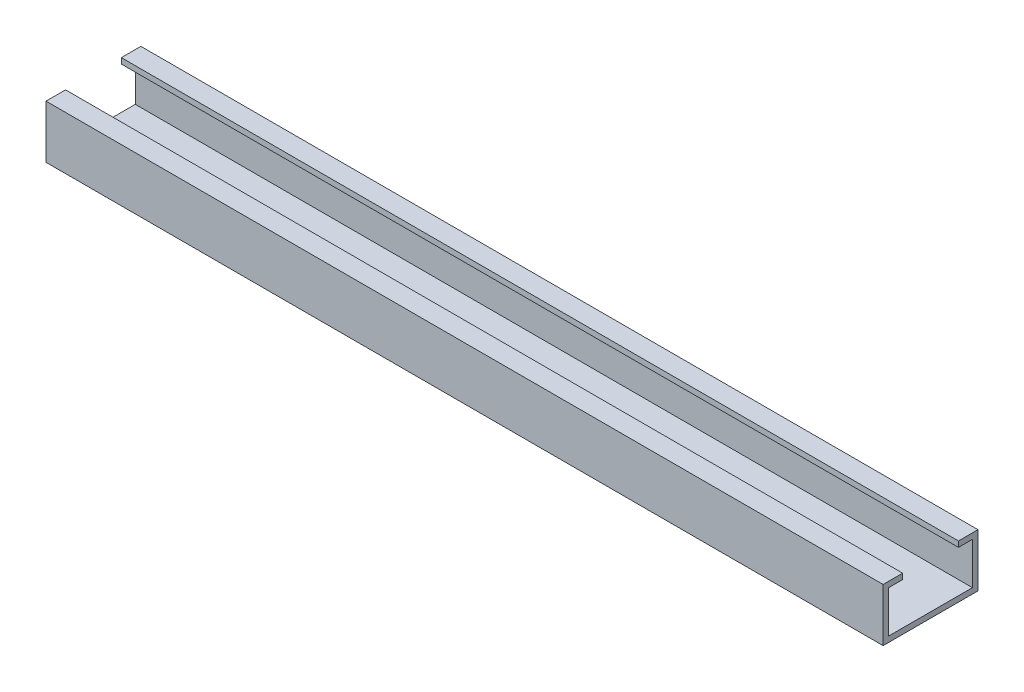
ISO-10303-21;
HEADER;
FILE_DESCRIPTION(('STEP AP214'),'2;1');
FILE_NAME('part.step','',(''),(''),'','','');
FILE_SCHEMA(('AUTOMOTIVE_DESIGN { 1 0 10303 214 1 1 1 1 }'));
ENDSEC;
DATA;
#1=APPLICATION_CONTEXT('core data for automotive mechanical design processes');
#2=APPLICATION_PROTOCOL_DEFINITION('international standard','automotive_design',2000,#1);
#3=PRODUCT_CONTEXT('',#1,'mechanical');
#4=PRODUCT('Part','Part','',(#3));
#5=PRODUCT_RELATED_PRODUCT_CATEGORY('part','',(#4));
#6=PRODUCT_DEFINITION_FORMATION('','',#4);
#7=PRODUCT_DEFINITION_CONTEXT('part definition',#1,'design');
#8=PRODUCT_DEFINITION('design','',#6,#7);
#9=PRODUCT_DEFINITION_SHAPE('','',#8);
#10=(LENGTH_UNIT() NAMED_UNIT(*) SI_UNIT(.MILLI.,.METRE.));
#11=(NAMED_UNIT(*) PLANE_ANGLE_UNIT() SI_UNIT($,.RADIAN.));
#12=(NAMED_UNIT(*) SI_UNIT($,.STERADIAN.) SOLID_ANGLE_UNIT());
#13=UNCERTAINTY_MEASURE_WITH_UNIT(LENGTH_MEASURE(1.E-05),#10,'distance_accuracy_value','');
#14=(GEOMETRIC_REPRESENTATION_CONTEXT(3) GLOBAL_UNCERTAINTY_ASSIGNED_CONTEXT((#13)) GLOBAL_UNIT_ASSIGNED_CONTEXT((#10,
#11,#12)) REPRESENTATION_CONTEXT('',''));
#15=CARTESIAN_POINT('',(0.,0.,0.));
#16=DIRECTION('',(0.,0.,1.));
#17=DIRECTION('',(1.,0.,0.));
#18=AXIS2_PLACEMENT_3D('',#15,#16,#17);
#19=CARTESIAN_POINT('',(300.,17.,-15.));
#20=DIRECTION('',(0.,-1.,0.));
#21=DIRECTION('',(0.,0.,-1.));
#22=AXIS2_PLACEMENT_3D('',#19,#20,#21);
#23=PLANE('',#22);
#24=DIRECTION('',(0.,0.,1.));
#25=VECTOR('',#24,1.);
#26=CARTESIAN_POINT('',(0.,17.,-15.));
#27=LINE('',#26,#25);
#28=CARTESIAN_POINT('',(0.,17.,-17.));
#29=VERTEX_POINT('',#28);
#30=CARTESIAN_POINT('',(0.,17.,-10.));
#31=VERTEX_POINT('',#30);
#32=EDGE_CURVE('E164',#29,#31,#27,.T.);
#33=ORIENTED_EDGE('',*,*,#32,.T.);
#34=DIRECTION('',(-1.,0.,0.));
#35=VECTOR('',#34,1.);
#36=CARTESIAN_POINT('',(300.,17.,-10.));
#37=LINE('',#36,#35);
#38=CARTESIAN_POINT('',(300.,17.,-10.));
#39=VERTEX_POINT('',#38);
#40=EDGE_CURVE('E11',#39,#31,#37,.T.);
#41=ORIENTED_EDGE('',*,*,#40,.F.);
#42=DIRECTION('',(0.,0.,1.));
#43=VECTOR('',#42,1.);
#44=CARTESIAN_POINT('',(300.,17.,-15.));
#45=LINE('',#44,#43);
#46=CARTESIAN_POINT('',(300.,17.,-17.));
#47=VERTEX_POINT('',#46);
#48=EDGE_CURVE('E108',#47,#39,#45,.T.);
#49=ORIENTED_EDGE('',*,*,#48,.F.);
#50=DIRECTION('',(-1.,0.,0.));
#51=VECTOR('',#50,1.);
#52=CARTESIAN_POINT('',(300.,17.,-17.));
#53=LINE('',#52,#51);
#54=EDGE_CURVE('E160',#47,#29,#53,.T.);
#55=ORIENTED_EDGE('',*,*,#54,.T.);
#56=EDGE_LOOP('',(#33,#41,#49,#55));
#57=FACE_BOUND('',#56,.T.);
#58=ADVANCED_FACE('F39',(#57),#23,.F.);
#59=CARTESIAN_POINT('',(300.,15.,-10.));
#60=DIRECTION('',(0.,0.,1.));
#61=DIRECTION('',(1.,0.,0.));
#62=AXIS2_PLACEMENT_3D('',#59,#60,#61);
#63=PLANE('',#62);
#64=DIRECTION('',(0.,1.,0.));
#65=VECTOR('',#64,1.);
#66=CARTESIAN_POINT('',(0.,15.,-10.));
#67=LINE('',#66,#65);
#68=CARTESIAN_POINT('',(0.,15.,-10.));
#69=VERTEX_POINT('',#68);
#70=EDGE_CURVE('E168',#69,#31,#67,.T.);
#71=ORIENTED_EDGE('',*,*,#70,.F.);
#72=DIRECTION('',(-1.,0.,0.));
#73=VECTOR('',#72,1.);
#74=CARTESIAN_POINT('',(300.,15.,-10.));
#75=LINE('',#74,#73);
#76=CARTESIAN_POINT('',(300.,15.,-10.));
#77=VERTEX_POINT('',#76);
#78=EDGE_CURVE('E48',#77,#69,#75,.T.);
#79=ORIENTED_EDGE('',*,*,#78,.F.);
#80=DIRECTION('',(0.,1.,0.));
#81=VECTOR('',#80,1.);
#82=CARTESIAN_POINT('',(300.,15.,-10.));
#83=LINE('',#82,#81);
#84=EDGE_CURVE('E251',#77,#39,#83,.T.);
#85=ORIENTED_EDGE('',*,*,#84,.T.);
#86=ORIENTED_EDGE('',*,*,#40,.T.);
#87=EDGE_LOOP('',(#71,#79,#85,#86));
#88=FACE_BOUND('',#87,.T.);
#89=ADVANCED_FACE('F238',(#88),#63,.T.);
#90=CARTESIAN_POINT('',(300.,15.,-15.));
#91=DIRECTION('',(0.,-1.,0.));
#92=DIRECTION('',(0.,0.,-1.));
#93=AXIS2_PLACEMENT_3D('',#90,#91,#92);
#94=PLANE('',#93);
#95=DIRECTION('',(0.,0.,1.));
#96=VECTOR('',#95,1.);
#97=CARTESIAN_POINT('',(0.,15.,-15.));
#98=LINE('',#97,#96);
#99=CARTESIAN_POINT('',(0.,15.,-15.));
#100=VERTEX_POINT('',#99);
#101=EDGE_CURVE('E172',#100,#69,#98,.T.);
#102=ORIENTED_EDGE('',*,*,#101,.F.);
#103=DIRECTION('',(-1.,0.,0.));
#104=VECTOR('',#103,1.);
#105=CARTESIAN_POINT('',(300.,15.,-15.));
#106=LINE('',#105,#104);
#107=CARTESIAN_POINT('',(300.,15.,-15.));
#108=VERTEX_POINT('',#107);
#109=EDGE_CURVE('E226',#108,#100,#106,.T.);
#110=ORIENTED_EDGE('',*,*,#109,.F.);
#111=DIRECTION('',(0.,0.,1.));
#112=VECTOR('',#111,1.);
#113=CARTESIAN_POINT('',(300.,15.,-15.));
#114=LINE('',#113,#112);
#115=EDGE_CURVE('E235',#108,#77,#114,.T.);
#116=ORIENTED_EDGE('',*,*,#115,.T.);
#117=ORIENTED_EDGE('',*,*,#78,.T.);
#118=EDGE_LOOP('',(#102,#110,#116,#117));
#119=FACE_BOUND('',#118,.T.);
#120=ADVANCED_FACE('F233',(#119),#94,.T.);
#121=CARTESIAN_POINT('',(300.,0.,-15.));
#122=DIRECTION('',(0.,0.,1.));
#123=DIRECTION('',(1.,0.,0.));
#124=AXIS2_PLACEMENT_3D('',#121,#122,#123);
#125=PLANE('',#124);
#126=DIRECTION('',(0.,1.,0.));
#127=VECTOR('',#126,1.);
#128=CARTESIAN_POINT('',(0.,0.,-15.));
#129=LINE('',#128,#127);
#130=CARTESIAN_POINT('',(0.,0.,-15.));
#131=VERTEX_POINT('',#130);
#132=EDGE_CURVE('E176',#131,#100,#129,.T.);
#133=ORIENTED_EDGE('',*,*,#132,.F.);
#134=DIRECTION('',(-1.,0.,0.));
#135=VECTOR('',#134,1.);
#136=CARTESIAN_POINT('',(300.,0.,-15.));
#137=LINE('',#136,#135);
#138=CARTESIAN_POINT('',(300.,0.,-15.));
#139=VERTEX_POINT('',#138);
#140=EDGE_CURVE('E223',#139,#131,#137,.T.);
#141=ORIENTED_EDGE('',*,*,#140,.F.);
#142=DIRECTION('',(0.,1.,0.));
#143=VECTOR('',#142,1.);
#144=CARTESIAN_POINT('',(300.,0.,-15.));
#145=LINE('',#144,#143);
#146=EDGE_CURVE('E248',#139,#108,#145,.T.);
#147=ORIENTED_EDGE('',*,*,#146,.T.);
#148=ORIENTED_EDGE('',*,*,#109,.T.);
#149=EDGE_LOOP('',(#133,#141,#147,#148));
#150=FACE_BOUND('',#149,.T.);
#151=ADVANCED_FACE('F245',(#150),#125,.T.);
#152=CARTESIAN_POINT('',(300.,0.,15.));
#153=DIRECTION('',(0.,1.,0.));
#154=DIRECTION('',(0.,0.,1.));
#155=AXIS2_PLACEMENT_3D('',#152,#153,#154);
#156=PLANE('',#155);
#157=DIRECTION('',(0.,0.,-1.));
#158=VECTOR('',#157,1.);
#159=CARTESIAN_POINT('',(0.,0.,15.));
#160=LINE('',#159,#158);
#161=CARTESIAN_POINT('',(0.,0.,15.));
#162=VERTEX_POINT('',#161);
#163=EDGE_CURVE('E180',#162,#131,#160,.T.);
#164=ORIENTED_EDGE('',*,*,#163,.F.);
#165=DIRECTION('',(-1.,0.,0.));
#166=VECTOR('',#165,1.);
#167=CARTESIAN_POINT('',(300.,0.,15.));
#168=LINE('',#167,#166);
#169=CARTESIAN_POINT('',(300.,0.,15.));
#170=VERTEX_POINT('',#169);
#171=EDGE_CURVE('E220',#170,#162,#168,.T.);
#172=ORIENTED_EDGE('',*,*,#171,.F.);
#173=DIRECTION('',(0.,0.,-1.));
#174=VECTOR('',#173,1.);
#175=CARTESIAN_POINT('',(300.,0.,15.));
#176=LINE('',#175,#174);
#177=EDGE_CURVE('E256',#170,#139,#176,.T.);
#178=ORIENTED_EDGE('',*,*,#177,.T.);
#179=ORIENTED_EDGE('',*,*,#140,.T.);
#180=EDGE_LOOP('',(#164,#172,#178,#179));
#181=FACE_BOUND('',#180,.T.);
#182=ADVANCED_FACE('F361',(#181),#156,.T.);
#183=CARTESIAN_POINT('',(300.,0.,15.));
#184=DIRECTION('',(0.,0.,-1.));
#185=DIRECTION('',(-1.,0.,0.));
#186=AXIS2_PLACEMENT_3D('',#183,#184,#185);
#187=PLANE('',#186);
#188=DIRECTION('',(0.,-1.,0.));
#189=VECTOR('',#188,1.);
#190=CARTESIAN_POINT('',(0.,0.,15.));
#191=LINE('',#190,#189);
#192=CARTESIAN_POINT('',(0.,15.,15.));
#193=VERTEX_POINT('',#192);
#194=EDGE_CURVE('E184',#193,#162,#191,.T.);
#195=ORIENTED_EDGE('',*,*,#194,.F.);
#196=DIRECTION('',(-1.,0.,0.));
#197=VECTOR('',#196,1.);
#198=CARTESIAN_POINT('',(300.,15.,15.));
#199=LINE('',#198,#197);
#200=CARTESIAN_POINT('',(300.,15.,15.));
#201=VERTEX_POINT('',#200);
#202=EDGE_CURVE('E217',#201,#193,#199,.T.);
#203=ORIENTED_EDGE('',*,*,#202,.F.);
#204=DIRECTION('',(0.,-1.,0.));
#205=VECTOR('',#204,1.);
#206=CARTESIAN_POINT('',(300.,0.,15.));
#207=LINE('',#206,#205);
#208=EDGE_CURVE('E263',#201,#170,#207,.T.);
#209=ORIENTED_EDGE('',*,*,#208,.T.);
#210=ORIENTED_EDGE('',*,*,#171,.T.);
#211=EDGE_LOOP('',(#195,#203,#209,#210));
#212=FACE_BOUND('',#211,.T.);
#213=ADVANCED_FACE('F352',(#212),#187,.T.);
#214=CARTESIAN_POINT('',(300.,15.,15.));
#215=DIRECTION('',(0.,-1.,0.));
#216=DIRECTION('',(0.,0.,-1.));
#217=AXIS2_PLACEMENT_3D('',#214,#215,#216);
#218=PLANE('',#217);
#219=DIRECTION('',(0.,0.,1.));
#220=VECTOR('',#219,1.);
#221=CARTESIAN_POINT('',(0.,15.,15.));
#222=LINE('',#221,#220);
#223=CARTESIAN_POINT('',(0.,15.,10.));
#224=VERTEX_POINT('',#223);
#225=EDGE_CURVE('E188',#224,#193,#222,.T.);
#226=ORIENTED_EDGE('',*,*,#225,.F.);
#227=DIRECTION('',(-1.,0.,0.));
#228=VECTOR('',#227,1.);
#229=CARTESIAN_POINT('',(300.,15.,10.));
#230=LINE('',#229,#228);
#231=CARTESIAN_POINT('',(300.,15.,10.));
#232=VERTEX_POINT('',#231);
#233=EDGE_CURVE('E214',#232,#224,#230,.T.);
#234=ORIENTED_EDGE('',*,*,#233,.F.);
#235=DIRECTION('',(0.,0.,1.));
#236=VECTOR('',#235,1.);
#237=CARTESIAN_POINT('',(300.,15.,15.));
#238=LINE('',#237,#236);
#239=EDGE_CURVE('E267',#232,#201,#238,.T.);
#240=ORIENTED_EDGE('',*,*,#239,.T.);
#241=ORIENTED_EDGE('',*,*,#202,.T.);
#242=EDGE_LOOP('',(#226,#234,#240,#241));
#243=FACE_BOUND('',#242,.T.);
#244=ADVANCED_FACE('F282',(#243),#218,.T.);
#245=CARTESIAN_POINT('',(300.,17.,10.));
#246=DIRECTION('',(0.,0.,-1.));
#247=DIRECTION('',(-1.,0.,0.));
#248=AXIS2_PLACEMENT_3D('',#245,#246,#247);
#249=PLANE('',#248);
#250=DIRECTION('',(0.,-1.,0.));
#251=VECTOR('',#250,1.);
#252=CARTESIAN_POINT('',(0.,17.,10.));
#253=LINE('',#252,#251);
#254=CARTESIAN_POINT('',(0.,17.,10.));
#255=VERTEX_POINT('',#254);
#256=EDGE_CURVE('E192',#255,#224,#253,.T.);
#257=ORIENTED_EDGE('',*,*,#256,.F.);
#258=DIRECTION('',(-1.,0.,0.));
#259=VECTOR('',#258,1.);
#260=CARTESIAN_POINT('',(300.,17.,10.));
#261=LINE('',#260,#259);
#262=CARTESIAN_POINT('',(300.,17.,10.));
#263=VERTEX_POINT('',#262);
#264=EDGE_CURVE('E211',#263,#255,#261,.T.);
#265=ORIENTED_EDGE('',*,*,#264,.F.);
#266=DIRECTION('',(0.,-1.,0.));
#267=VECTOR('',#266,1.);
#268=CARTESIAN_POINT('',(300.,17.,10.));
#269=LINE('',#268,#267);
#270=EDGE_CURVE('E271',#263,#232,#269,.T.);
#271=ORIENTED_EDGE('',*,*,#270,.T.);
#272=ORIENTED_EDGE('',*,*,#233,.T.);
#273=EDGE_LOOP('',(#257,#265,#271,#272));
#274=FACE_BOUND('',#273,.T.);
#275=ADVANCED_FACE('F277',(#274),#249,.T.);
#276=CARTESIAN_POINT('',(300.,17.,15.));
#277=DIRECTION('',(0.,-1.,0.));
#278=DIRECTION('',(0.,0.,-1.));
#279=AXIS2_PLACEMENT_3D('',#276,#277,#278);
#280=PLANE('',#279);
#281=DIRECTION('',(0.,0.,-1.));
#282=VECTOR('',#281,1.);
#283=CARTESIAN_POINT('',(0.,17.,15.));
#284=LINE('',#283,#282);
#285=CARTESIAN_POINT('',(0.,17.,17.));
#286=VERTEX_POINT('',#285);
#287=EDGE_CURVE('E196',#255,#286,#284,.F.);
#288=ORIENTED_EDGE('',*,*,#287,.T.);
#289=DIRECTION('',(-1.,0.,0.));
#290=VECTOR('',#289,1.);
#291=CARTESIAN_POINT('',(300.,17.,17.));
#292=LINE('',#291,#290);
#293=CARTESIAN_POINT('',(300.,17.,17.));
#294=VERTEX_POINT('',#293);
#295=EDGE_CURVE('E153',#294,#286,#292,.T.);
#296=ORIENTED_EDGE('',*,*,#295,.F.);
#297=DIRECTION('',(0.,0.,-1.));
#298=VECTOR('',#297,1.);
#299=CARTESIAN_POINT('',(300.,17.,15.));
#300=LINE('',#299,#298);
#301=EDGE_CURVE('E142',#263,#294,#300,.F.);
#302=ORIENTED_EDGE('',*,*,#301,.F.);
#303=ORIENTED_EDGE('',*,*,#264,.T.);
#304=EDGE_LOOP('',(#288,#296,#302,#303));
#305=FACE_BOUND('',#304,.T.);
#306=ADVANCED_FACE('F286',(#305),#280,.F.);
#307=CARTESIAN_POINT('',(300.,0.,17.));
#308=DIRECTION('',(0.,0.,-1.));
#309=DIRECTION('',(-1.,0.,0.));
#310=AXIS2_PLACEMENT_3D('',#307,#308,#309);
#311=PLANE('',#310);
#312=DIRECTION('',(0.,1.,0.));
#313=VECTOR('',#312,1.);
#314=CARTESIAN_POINT('',(0.,0.,17.));
#315=LINE('',#314,#313);
#316=CARTESIAN_POINT('',(0.,-2.,17.));
#317=VERTEX_POINT('',#316);
#318=EDGE_CURVE('E151',#286,#317,#315,.F.);
#319=ORIENTED_EDGE('',*,*,#318,.T.);
#320=DIRECTION('',(-1.,0.,0.));
#321=VECTOR('',#320,1.);
#322=CARTESIAN_POINT('',(300.,-2.,17.));
#323=LINE('',#322,#321);
#324=CARTESIAN_POINT('',(300.,-2.,17.));
#325=VERTEX_POINT('',#324);
#326=EDGE_CURVE('E148',#325,#317,#323,.T.);
#327=ORIENTED_EDGE('',*,*,#326,.F.);
#328=DIRECTION('',(0.,1.,0.));
#329=VECTOR('',#328,1.);
#330=CARTESIAN_POINT('',(300.,0.,17.));
#331=LINE('',#330,#329);
#332=EDGE_CURVE('E135',#294,#325,#331,.F.);
#333=ORIENTED_EDGE('',*,*,#332,.F.);
#334=ORIENTED_EDGE('',*,*,#295,.T.);
#335=EDGE_LOOP('',(#319,#327,#333,#334));
#336=FACE_BOUND('',#335,.T.);
#337=ADVANCED_FACE('F149',(#336),#311,.F.);
#338=CARTESIAN_POINT('',(300.,-2.,15.));
#339=DIRECTION('',(0.,1.,0.));
#340=DIRECTION('',(0.,0.,1.));
#341=AXIS2_PLACEMENT_3D('',#338,#339,#340);
#342=PLANE('',#341);
#343=DIRECTION('',(0.,0.,-1.));
#344=VECTOR('',#343,1.);
#345=CARTESIAN_POINT('',(0.,-2.,15.));
#346=LINE('',#345,#344);
#347=CARTESIAN_POINT('',(0.,-2.,-17.));
#348=VERTEX_POINT('',#347);
#349=EDGE_CURVE('E96',#317,#348,#346,.T.);
#350=ORIENTED_EDGE('',*,*,#349,.T.);
#351=DIRECTION('',(-1.,0.,0.));
#352=VECTOR('',#351,1.);
#353=CARTESIAN_POINT('',(300.,-2.,-17.));
#354=LINE('',#353,#352);
#355=CARTESIAN_POINT('',(300.,-2.,-17.));
#356=VERTEX_POINT('',#355);
#357=EDGE_CURVE('E154',#356,#348,#354,.T.);
#358=ORIENTED_EDGE('',*,*,#357,.F.);
#359=DIRECTION('',(0.,0.,-1.));
#360=VECTOR('',#359,1.);
#361=CARTESIAN_POINT('',(300.,-2.,15.));
#362=LINE('',#361,#360);
#363=EDGE_CURVE('E139',#325,#356,#362,.T.);
#364=ORIENTED_EDGE('',*,*,#363,.F.);
#365=ORIENTED_EDGE('',*,*,#326,.T.);
#366=EDGE_LOOP('',(#350,#358,#364,#365));
#367=FACE_BOUND('',#366,.T.);
#368=ADVANCED_FACE('F156',(#367),#342,.F.);
#369=CARTESIAN_POINT('',(300.,0.,-17.));
#370=DIRECTION('',(0.,0.,1.));
#371=DIRECTION('',(1.,0.,0.));
#372=AXIS2_PLACEMENT_3D('',#369,#370,#371);
#373=PLANE('',#372);
#374=DIRECTION('',(0.,1.,0.));
#375=VECTOR('',#374,1.);
#376=CARTESIAN_POINT('',(0.,0.,-17.));
#377=LINE('',#376,#375);
#378=EDGE_CURVE('E102',#348,#29,#377,.T.);
#379=ORIENTED_EDGE('',*,*,#378,.T.);
#380=ORIENTED_EDGE('',*,*,#54,.F.);
#381=DIRECTION('',(0.,1.,0.));
#382=VECTOR('',#381,1.);
#383=CARTESIAN_POINT('',(300.,0.,-17.));
#384=LINE('',#383,#382);
#385=EDGE_CURVE('E56',#356,#47,#384,.T.);
#386=ORIENTED_EDGE('',*,*,#385,.F.);
#387=ORIENTED_EDGE('',*,*,#357,.T.);
#388=EDGE_LOOP('',(#379,#380,#386,#387));
#389=FACE_BOUND('',#388,.T.);
#390=ADVANCED_FACE('F300',(#389),#373,.F.);
#391=CARTESIAN_POINT('',(300.,0.,0.));
#392=DIRECTION('',(-1.,0.,0.));
#393=DIRECTION('',(0.,0.,1.));
#394=AXIS2_PLACEMENT_3D('',#391,#392,#393);
#395=PLANE('',#394);
#396=ORIENTED_EDGE('',*,*,#48,.T.);
#397=ORIENTED_EDGE('',*,*,#84,.F.);
#398=ORIENTED_EDGE('',*,*,#115,.F.);
#399=ORIENTED_EDGE('',*,*,#146,.F.);
#400=ORIENTED_EDGE('',*,*,#177,.F.);
#401=ORIENTED_EDGE('',*,*,#208,.F.);
#402=ORIENTED_EDGE('',*,*,#239,.F.);
#403=ORIENTED_EDGE('',*,*,#270,.F.);
#404=ORIENTED_EDGE('',*,*,#301,.T.);
#405=ORIENTED_EDGE('',*,*,#332,.T.);
#406=ORIENTED_EDGE('',*,*,#363,.T.);
#407=ORIENTED_EDGE('',*,*,#385,.T.);
#408=EDGE_LOOP('',(#396,#397,#398,#399,#400,#401,#402,#403,#404,#405,#406,#407));
#409=FACE_BOUND('',#408,.T.);
#410=ADVANCED_FACE('F137',(#409),#395,.F.);
#411=CARTESIAN_POINT('',(0.,0.,0.));
#412=DIRECTION('',(-1.,0.,0.));
#413=DIRECTION('',(0.,0.,1.));
#414=AXIS2_PLACEMENT_3D('',#411,#412,#413);
#415=PLANE('',#414);
#416=ORIENTED_EDGE('',*,*,#32,.F.);
#417=ORIENTED_EDGE('',*,*,#378,.F.);
#418=ORIENTED_EDGE('',*,*,#349,.F.);
#419=ORIENTED_EDGE('',*,*,#318,.F.);
#420=ORIENTED_EDGE('',*,*,#287,.F.);
#421=ORIENTED_EDGE('',*,*,#256,.T.);
#422=ORIENTED_EDGE('',*,*,#225,.T.);
#423=ORIENTED_EDGE('',*,*,#194,.T.);
#424=ORIENTED_EDGE('',*,*,#163,.T.);
#425=ORIENTED_EDGE('',*,*,#132,.T.);
#426=ORIENTED_EDGE('',*,*,#101,.T.);
#427=ORIENTED_EDGE('',*,*,#70,.T.);
#428=EDGE_LOOP('',(#416,#417,#418,#419,#420,#421,#422,#423,#424,#425,#426,#427));
#429=FACE_BOUND('',#428,.T.);
#430=ADVANCED_FACE('F241',(#429),#415,.T.);
#431=CLOSED_SHELL('',(#58,#89,#120,#151,#182,#213,#244,#275,#306,#337,#368,#390,#410,#430));
#432=MANIFOLD_SOLID_BREP('B2',#431);
#433=ADVANCED_BREP_SHAPE_REPRESENTATION('',(#18,#432),#14);
#434=SHAPE_DEFINITION_REPRESENTATION(#9,#433);
ENDSEC;
END-ISO-10303-21;
